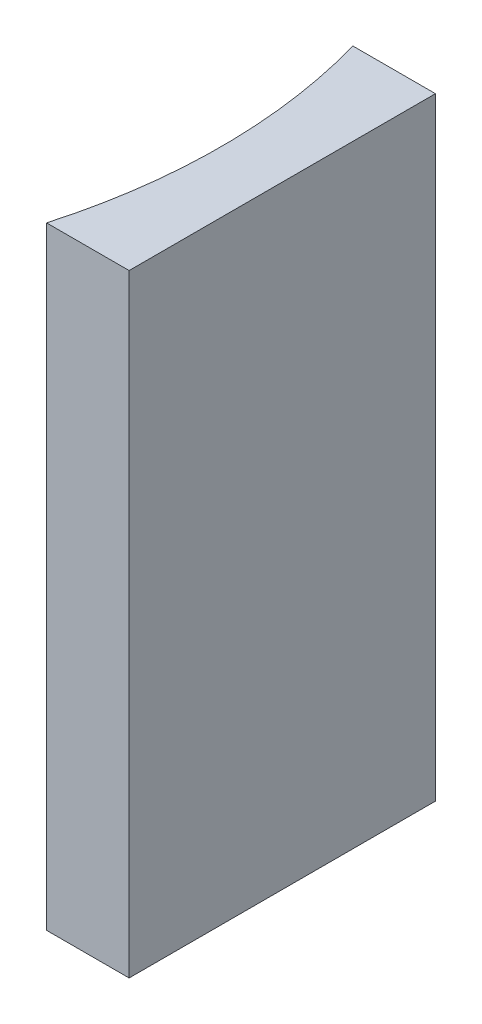
ISO-10303-21;
HEADER;
FILE_DESCRIPTION(('STEP AP214'),'2;1');
FILE_NAME('part.step','',(''),(''),'','','');
FILE_SCHEMA(('AUTOMOTIVE_DESIGN { 1 0 10303 214 1 1 1 1 }'));
ENDSEC;
DATA;
#1=APPLICATION_CONTEXT('core data for automotive mechanical design processes');
#2=APPLICATION_PROTOCOL_DEFINITION('international standard','automotive_design',2000,#1);
#3=PRODUCT_CONTEXT('',#1,'mechanical');
#4=PRODUCT('Part','Part','',(#3));
#5=PRODUCT_RELATED_PRODUCT_CATEGORY('part','',(#4));
#6=PRODUCT_DEFINITION_FORMATION('','',#4);
#7=PRODUCT_DEFINITION_CONTEXT('part definition',#1,'design');
#8=PRODUCT_DEFINITION('design','',#6,#7);
#9=PRODUCT_DEFINITION_SHAPE('','',#8);
#10=(LENGTH_UNIT() NAMED_UNIT(*) SI_UNIT(.MILLI.,.METRE.));
#11=(NAMED_UNIT(*) PLANE_ANGLE_UNIT() SI_UNIT($,.RADIAN.));
#12=(NAMED_UNIT(*) SI_UNIT($,.STERADIAN.) SOLID_ANGLE_UNIT());
#13=UNCERTAINTY_MEASURE_WITH_UNIT(LENGTH_MEASURE(1.E-05),#10,'distance_accuracy_value','');
#14=(GEOMETRIC_REPRESENTATION_CONTEXT(3) GLOBAL_UNCERTAINTY_ASSIGNED_CONTEXT((#13)) GLOBAL_UNIT_ASSIGNED_CONTEXT((#10,
#11,#12)) REPRESENTATION_CONTEXT('',''));
#15=CARTESIAN_POINT('',(0.,0.,0.));
#16=DIRECTION('',(0.,0.,1.));
#17=DIRECTION('',(1.,0.,0.));
#18=AXIS2_PLACEMENT_3D('',#15,#16,#17);
#19=CARTESIAN_POINT('',(0.,20.,0.));
#20=DIRECTION('',(0.,0.,1.));
#21=DIRECTION('',(1.,0.,0.));
#22=AXIS2_PLACEMENT_3D('',#19,#20,#21);
#23=PLANE('',#22);
#24=DIRECTION('',(-1.,0.,0.));
#25=VECTOR('',#24,1.);
#26=CARTESIAN_POINT('',(0.,0.,0.));
#27=LINE('',#26,#25);
#28=CARTESIAN_POINT('',(0.,0.,0.));
#29=VERTEX_POINT('',#28);
#30=CARTESIAN_POINT('',(-2.69551702886011,0.,0.));
#31=VERTEX_POINT('',#30);
#32=EDGE_CURVE('E108',#29,#31,#27,.T.);
#33=ORIENTED_EDGE('',*,*,#32,.T.);
#34=DIRECTION('',(0.,-1.,0.));
#35=VECTOR('',#34,1.);
#36=CARTESIAN_POINT('',(-2.69551702886011,20.,0.));
#37=LINE('',#36,#35);
#38=CARTESIAN_POINT('',(-2.69551702886011,20.,0.));
#39=VERTEX_POINT('',#38);
#40=EDGE_CURVE('E11',#39,#31,#37,.T.);
#41=ORIENTED_EDGE('',*,*,#40,.F.);
#42=DIRECTION('',(-1.,0.,0.));
#43=VECTOR('',#42,1.);
#44=CARTESIAN_POINT('',(0.,20.,0.));
#45=LINE('',#44,#43);
#46=CARTESIAN_POINT('',(0.,20.,0.));
#47=VERTEX_POINT('',#46);
#48=EDGE_CURVE('E91',#47,#39,#45,.T.);
#49=ORIENTED_EDGE('',*,*,#48,.F.);
#50=DIRECTION('',(0.,-1.,0.));
#51=VECTOR('',#50,1.);
#52=CARTESIAN_POINT('',(0.,20.,0.));
#53=LINE('',#52,#51);
#54=EDGE_CURVE('E104',#47,#29,#53,.T.);
#55=ORIENTED_EDGE('',*,*,#54,.T.);
#56=EDGE_LOOP('',(#33,#41,#49,#55));
#57=FACE_BOUND('',#56,.T.);
#58=ADVANCED_FACE('F39',(#57),#23,.F.);
#59=CARTESIAN_POINT('',(-20.32,20.,5.));
#60=DIRECTION('',(0.,-1.,0.));
#61=DIRECTION('',(0.,0.,-1.));
#62=AXIS2_PLACEMENT_3D('',#59,#60,#61);
#63=CYLINDRICAL_SURFACE('',#62,18.32);
#64=CARTESIAN_POINT('',(-20.32,0.,5.));
#65=DIRECTION('',(0.,-1.,0.));
#66=DIRECTION('',(0.,0.,1.));
#67=AXIS2_PLACEMENT_3D('',#64,#65,#66);
#68=CIRCLE('',#67,18.32);
#69=CARTESIAN_POINT('',(-2.69551702886011,0.,10.));
#70=VERTEX_POINT('',#69);
#71=EDGE_CURVE('E96',#31,#70,#68,.T.);
#72=ORIENTED_EDGE('',*,*,#71,.T.);
#73=DIRECTION('',(0.,-1.,0.));
#74=VECTOR('',#73,1.);
#75=CARTESIAN_POINT('',(-2.69551702886011,20.,10.));
#76=LINE('',#75,#74);
#77=CARTESIAN_POINT('',(-2.69551702886011,20.,10.));
#78=VERTEX_POINT('',#77);
#79=EDGE_CURVE('E48',#78,#70,#76,.T.);
#80=ORIENTED_EDGE('',*,*,#79,.F.);
#81=CARTESIAN_POINT('',(-20.32,20.,5.));
#82=DIRECTION('',(0.,-1.,0.));
#83=DIRECTION('',(0.,0.,1.));
#84=AXIS2_PLACEMENT_3D('',#81,#82,#83);
#85=CIRCLE('',#84,18.32);
#86=EDGE_CURVE('E86',#39,#78,#85,.T.);
#87=ORIENTED_EDGE('',*,*,#86,.F.);
#88=ORIENTED_EDGE('',*,*,#40,.T.);
#89=EDGE_LOOP('',(#72,#80,#87,#88));
#90=FACE_BOUND('',#89,.T.);
#91=ADVANCED_FACE('F95',(#90),#63,.F.);
#92=CARTESIAN_POINT('',(0.,20.,10.));
#93=DIRECTION('',(0.,0.,-1.));
#94=DIRECTION('',(-1.,0.,0.));
#95=AXIS2_PLACEMENT_3D('',#92,#93,#94);
#96=PLANE('',#95);
#97=DIRECTION('',(1.,0.,0.));
#98=VECTOR('',#97,1.);
#99=CARTESIAN_POINT('',(0.,0.,10.));
#100=LINE('',#99,#98);
#101=CARTESIAN_POINT('',(0.,0.,10.));
#102=VERTEX_POINT('',#101);
#103=EDGE_CURVE('E73',#70,#102,#100,.T.);
#104=ORIENTED_EDGE('',*,*,#103,.T.);
#105=DIRECTION('',(0.,-1.,0.));
#106=VECTOR('',#105,1.);
#107=CARTESIAN_POINT('',(0.,20.,10.));
#108=LINE('',#107,#106);
#109=CARTESIAN_POINT('',(0.,20.,10.));
#110=VERTEX_POINT('',#109);
#111=EDGE_CURVE('E98',#110,#102,#108,.T.);
#112=ORIENTED_EDGE('',*,*,#111,.F.);
#113=DIRECTION('',(1.,0.,0.));
#114=VECTOR('',#113,1.);
#115=CARTESIAN_POINT('',(0.,20.,10.));
#116=LINE('',#115,#114);
#117=EDGE_CURVE('E89',#78,#110,#116,.T.);
#118=ORIENTED_EDGE('',*,*,#117,.F.);
#119=ORIENTED_EDGE('',*,*,#79,.T.);
#120=EDGE_LOOP('',(#104,#112,#118,#119));
#121=FACE_BOUND('',#120,.T.);
#122=ADVANCED_FACE('F99',(#121),#96,.F.);
#123=CARTESIAN_POINT('',(0.,20.,0.));
#124=DIRECTION('',(-1.,0.,0.));
#125=DIRECTION('',(0.,0.,1.));
#126=AXIS2_PLACEMENT_3D('',#123,#124,#125);
#127=PLANE('',#126);
#128=DIRECTION('',(0.,0.,-1.));
#129=VECTOR('',#128,1.);
#130=CARTESIAN_POINT('',(0.,0.,0.));
#131=LINE('',#130,#129);
#132=EDGE_CURVE('E79',#102,#29,#131,.T.);
#133=ORIENTED_EDGE('',*,*,#132,.T.);
#134=ORIENTED_EDGE('',*,*,#54,.F.);
#135=DIRECTION('',(0.,0.,-1.));
#136=VECTOR('',#135,1.);
#137=CARTESIAN_POINT('',(0.,20.,0.));
#138=LINE('',#137,#136);
#139=EDGE_CURVE('E56',#110,#47,#138,.T.);
#140=ORIENTED_EDGE('',*,*,#139,.F.);
#141=ORIENTED_EDGE('',*,*,#111,.T.);
#142=EDGE_LOOP('',(#133,#134,#140,#141));
#143=FACE_BOUND('',#142,.T.);
#144=ADVANCED_FACE('F120',(#143),#127,.F.);
#145=CARTESIAN_POINT('',(-20.32,20.,5.));
#146=DIRECTION('',(0.,1.,0.));
#147=DIRECTION('',(0.,0.,1.));
#148=AXIS2_PLACEMENT_3D('',#145,#146,#147);
#149=PLANE('',#148);
#150=ORIENTED_EDGE('',*,*,#48,.T.);
#151=ORIENTED_EDGE('',*,*,#86,.T.);
#152=ORIENTED_EDGE('',*,*,#117,.T.);
#153=ORIENTED_EDGE('',*,*,#139,.T.);
#154=EDGE_LOOP('',(#150,#151,#152,#153));
#155=FACE_BOUND('',#154,.T.);
#156=ADVANCED_FACE('F87',(#155),#149,.T.);
#157=CARTESIAN_POINT('',(-20.32,0.,5.));
#158=DIRECTION('',(0.,1.,0.));
#159=DIRECTION('',(0.,0.,1.));
#160=AXIS2_PLACEMENT_3D('',#157,#158,#159);
#161=PLANE('',#160);
#162=ORIENTED_EDGE('',*,*,#32,.F.);
#163=ORIENTED_EDGE('',*,*,#132,.F.);
#164=ORIENTED_EDGE('',*,*,#103,.F.);
#165=ORIENTED_EDGE('',*,*,#71,.F.);
#166=EDGE_LOOP('',(#162,#163,#164,#165));
#167=FACE_BOUND('',#166,.T.);
#168=ADVANCED_FACE('F123',(#167),#161,.F.);
#169=CLOSED_SHELL('',(#58,#91,#122,#144,#156,#168));
#170=MANIFOLD_SOLID_BREP('B2',#169);
#171=ADVANCED_BREP_SHAPE_REPRESENTATION('',(#18,#170),#14);
#172=SHAPE_DEFINITION_REPRESENTATION(#9,#171);
ENDSEC;
END-ISO-10303-21;
